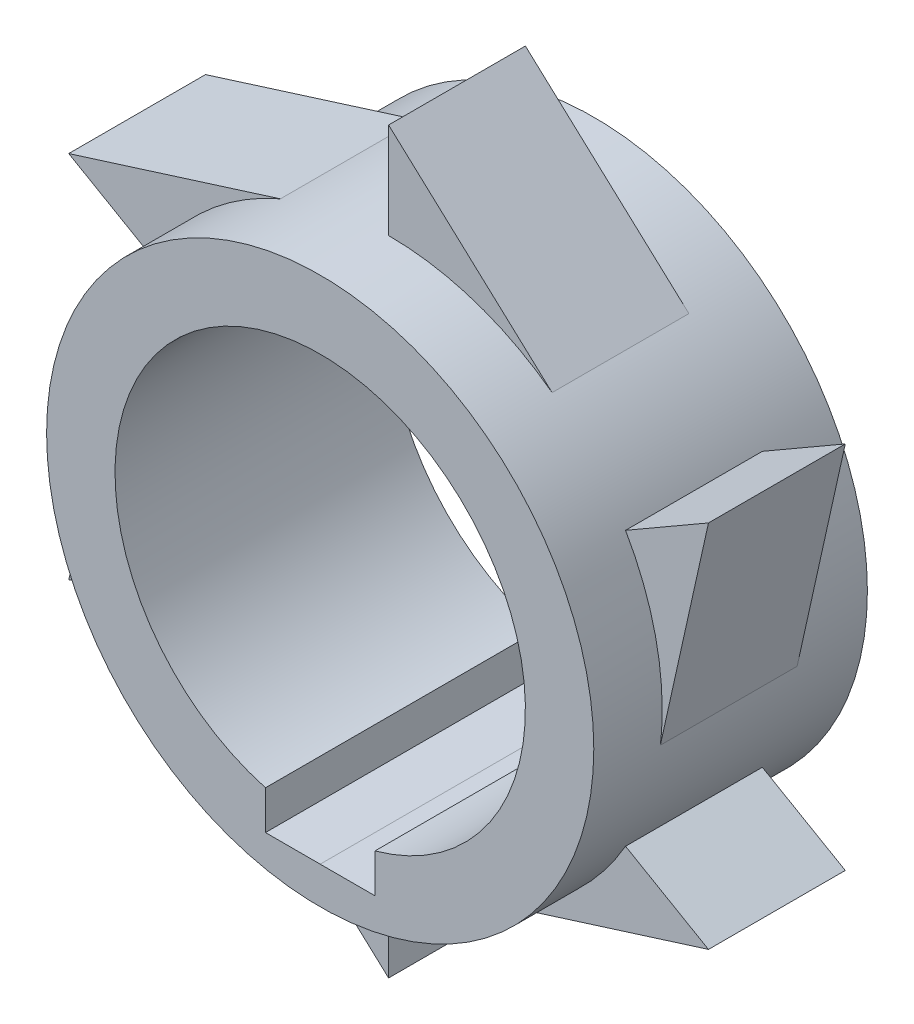
ISO-10303-21;
HEADER;
FILE_DESCRIPTION(('STEP AP214'),'2;1');
FILE_NAME('part.step','',(''),(''),'','','');
FILE_SCHEMA(('AUTOMOTIVE_DESIGN { 1 0 10303 214 1 1 1 1 }'));
ENDSEC;
DATA;
#1=APPLICATION_CONTEXT('core data for automotive mechanical design processes');
#2=APPLICATION_PROTOCOL_DEFINITION('international standard','automotive_design',2000,#1);
#3=PRODUCT_CONTEXT('',#1,'mechanical');
#4=PRODUCT('Part','Part','',(#3));
#5=PRODUCT_RELATED_PRODUCT_CATEGORY('part','',(#4));
#6=PRODUCT_DEFINITION_FORMATION('','',#4);
#7=PRODUCT_DEFINITION_CONTEXT('part definition',#1,'design');
#8=PRODUCT_DEFINITION('design','',#6,#7);
#9=PRODUCT_DEFINITION_SHAPE('','',#8);
#10=(LENGTH_UNIT() NAMED_UNIT(*) SI_UNIT(.MILLI.,.METRE.));
#11=(NAMED_UNIT(*) PLANE_ANGLE_UNIT() SI_UNIT($,.RADIAN.));
#12=(NAMED_UNIT(*) SI_UNIT($,.STERADIAN.) SOLID_ANGLE_UNIT());
#13=UNCERTAINTY_MEASURE_WITH_UNIT(LENGTH_MEASURE(1.E-05),#10,'distance_accuracy_value','');
#14=(GEOMETRIC_REPRESENTATION_CONTEXT(3) GLOBAL_UNCERTAINTY_ASSIGNED_CONTEXT((#13)) GLOBAL_UNIT_ASSIGNED_CONTEXT((#10,
#11,#12)) REPRESENTATION_CONTEXT('',''));
#15=CARTESIAN_POINT('',(0.,0.,0.));
#16=DIRECTION('',(0.,0.,1.));
#17=DIRECTION('',(1.,0.,0.));
#18=AXIS2_PLACEMENT_3D('',#15,#16,#17);
#19=CARTESIAN_POINT('',(0.,0.,20.));
#20=DIRECTION('',(0.,0.,1.));
#21=DIRECTION('',(1.,0.,0.));
#22=AXIS2_PLACEMENT_3D('',#19,#20,#21);
#23=PLANE('',#22);
#24=CARTESIAN_POINT('',(0.,0.,20.));
#25=DIRECTION('',(0.,0.,1.));
#26=DIRECTION('',(1.,0.,0.));
#27=AXIS2_PLACEMENT_3D('',#24,#25,#26);
#28=CIRCLE('',#27,20.);
#29=CARTESIAN_POINT('',(20.,0.,20.));
#30=VERTEX_POINT('',#29);
#31=EDGE_CURVE('E368',#30,#30,#28,.T.);
#32=ORIENTED_EDGE('',*,*,#31,.T.);
#33=EDGE_LOOP('',(#32));
#34=FACE_BOUND('',#33,.T.);
#35=DIRECTION('',(-1.,0.,0.));
#36=VECTOR('',#35,1.);
#37=CARTESIAN_POINT('',(0.,-17.2932558970192,20.));
#38=LINE('',#37,#36);
#39=CARTESIAN_POINT('',(0.,-17.2932558970192,20.));
#40=VERTEX_POINT('',#39);
#41=CARTESIAN_POINT('',(-4.,-17.2932558970192,20.));
#42=VERTEX_POINT('',#41);
#43=EDGE_CURVE('E358',#40,#42,#38,.T.);
#44=ORIENTED_EDGE('',*,*,#43,.T.);
#45=DIRECTION('',(0.,1.,0.));
#46=VECTOR('',#45,1.);
#47=CARTESIAN_POINT('',(-4.,0.,20.));
#48=LINE('',#47,#46);
#49=CARTESIAN_POINT('',(-4.,-14.456832294801,20.));
#50=VERTEX_POINT('',#49);
#51=EDGE_CURVE('E352',#42,#50,#48,.T.);
#52=ORIENTED_EDGE('',*,*,#51,.T.);
#53=CARTESIAN_POINT('',(0.,0.,20.));
#54=DIRECTION('',(0.,0.,1.));
#55=DIRECTION('',(1.,0.,0.));
#56=AXIS2_PLACEMENT_3D('',#53,#54,#55);
#57=CIRCLE('',#56,15.);
#58=CARTESIAN_POINT('',(4.,-14.456832294801,20.));
#59=VERTEX_POINT('',#58);
#60=EDGE_CURVE('E362',#59,#50,#57,.T.);
#61=ORIENTED_EDGE('',*,*,#60,.F.);
#62=DIRECTION('',(0.,-1.,0.));
#63=VECTOR('',#62,1.);
#64=CARTESIAN_POINT('',(4.,0.,20.));
#65=LINE('',#64,#63);
#66=CARTESIAN_POINT('',(4.,-17.2932558970192,20.));
#67=VERTEX_POINT('',#66);
#68=EDGE_CURVE('E347',#59,#67,#65,.T.);
#69=ORIENTED_EDGE('',*,*,#68,.T.);
#70=DIRECTION('',(-1.,0.,0.));
#71=VECTOR('',#70,1.);
#72=CARTESIAN_POINT('',(0.,-17.2932558970192,20.));
#73=LINE('',#72,#71);
#74=EDGE_CURVE('E355',#67,#40,#73,.T.);
#75=ORIENTED_EDGE('',*,*,#74,.T.);
#76=EDGE_LOOP('',(#44,#52,#61,#69,#75));
#77=FACE_BOUND('',#76,.T.);
#78=ADVANCED_FACE('F41',(#34,#77),#23,.T.);
#79=CARTESIAN_POINT('',(0.,0.,0.));
#80=DIRECTION('',(0.,0.,1.));
#81=DIRECTION('',(1.,0.,0.));
#82=AXIS2_PLACEMENT_3D('',#79,#80,#81);
#83=PLANE('',#82);
#84=CARTESIAN_POINT('',(0.,0.,0.));
#85=DIRECTION('',(0.,0.,1.));
#86=DIRECTION('',(1.,0.,0.));
#87=AXIS2_PLACEMENT_3D('',#84,#85,#86);
#88=CIRCLE('',#87,20.);
#89=CARTESIAN_POINT('',(20.,0.,0.));
#90=VERTEX_POINT('',#89);
#91=EDGE_CURVE('E365',#90,#90,#88,.T.);
#92=ORIENTED_EDGE('',*,*,#91,.F.);
#93=EDGE_LOOP('',(#92));
#94=FACE_BOUND('',#93,.T.);
#95=DIRECTION('',(0.,1.,0.));
#96=VECTOR('',#95,1.);
#97=CARTESIAN_POINT('',(-4.,0.,0.));
#98=LINE('',#97,#96);
#99=CARTESIAN_POINT('',(-4.,-17.2932558970192,0.));
#100=VERTEX_POINT('',#99);
#101=CARTESIAN_POINT('',(-4.,-14.456832294801,0.));
#102=VERTEX_POINT('',#101);
#103=EDGE_CURVE('E350',#100,#102,#98,.T.);
#104=ORIENTED_EDGE('',*,*,#103,.F.);
#105=DIRECTION('',(-1.,0.,0.));
#106=VECTOR('',#105,1.);
#107=CARTESIAN_POINT('',(0.,-17.2932558970192,0.));
#108=LINE('',#107,#106);
#109=CARTESIAN_POINT('',(0.,-17.2932558970192,0.));
#110=VERTEX_POINT('',#109);
#111=EDGE_CURVE('E12',#110,#100,#108,.T.);
#112=ORIENTED_EDGE('',*,*,#111,.F.);
#113=DIRECTION('',(-1.,0.,0.));
#114=VECTOR('',#113,1.);
#115=CARTESIAN_POINT('',(0.,-17.2932558970192,0.));
#116=LINE('',#115,#114);
#117=CARTESIAN_POINT('',(4.,-17.2932558970192,0.));
#118=VERTEX_POINT('',#117);
#119=EDGE_CURVE('E49',#118,#110,#116,.T.);
#120=ORIENTED_EDGE('',*,*,#119,.F.);
#121=DIRECTION('',(0.,-1.,0.));
#122=VECTOR('',#121,1.);
#123=CARTESIAN_POINT('',(4.,0.,0.));
#124=LINE('',#123,#122);
#125=CARTESIAN_POINT('',(4.,-14.456832294801,0.));
#126=VERTEX_POINT('',#125);
#127=EDGE_CURVE('E345',#126,#118,#124,.T.);
#128=ORIENTED_EDGE('',*,*,#127,.F.);
#129=CARTESIAN_POINT('',(0.,0.,0.));
#130=DIRECTION('',(0.,0.,1.));
#131=DIRECTION('',(1.,0.,0.));
#132=AXIS2_PLACEMENT_3D('',#129,#130,#131);
#133=CIRCLE('',#132,15.);
#134=EDGE_CURVE('E361',#126,#102,#133,.T.);
#135=ORIENTED_EDGE('',*,*,#134,.T.);
#136=EDGE_LOOP('',(#104,#112,#120,#128,#135));
#137=FACE_BOUND('',#136,.T.);
#138=ADVANCED_FACE('F390',(#94,#137),#83,.F.);
#139=CARTESIAN_POINT('',(0.,0.,20.));
#140=DIRECTION('',(0.,0.,-1.));
#141=DIRECTION('',(-1.,0.,0.));
#142=AXIS2_PLACEMENT_3D('',#139,#140,#141);
#143=CYLINDRICAL_SURFACE('',#142,15.);
#144=ORIENTED_EDGE('',*,*,#60,.T.);
#145=DIRECTION('',(0.,0.,-1.));
#146=VECTOR('',#145,1.);
#147=CARTESIAN_POINT('',(-4.,-14.456832294801,20.));
#148=LINE('',#147,#146);
#149=EDGE_CURVE('E376',#50,#102,#148,.T.);
#150=ORIENTED_EDGE('',*,*,#149,.T.);
#151=ORIENTED_EDGE('',*,*,#134,.F.);
#152=DIRECTION('',(0.,0.,-1.));
#153=VECTOR('',#152,1.);
#154=CARTESIAN_POINT('',(4.,-14.456832294801,20.));
#155=LINE('',#154,#153);
#156=EDGE_CURVE('E371',#126,#59,#155,.F.);
#157=ORIENTED_EDGE('',*,*,#156,.T.);
#158=EDGE_LOOP('',(#144,#150,#151,#157));
#159=FACE_BOUND('',#158,.T.);
#160=ADVANCED_FACE('F395',(#159),#143,.F.);
#161=CARTESIAN_POINT('',(0.,0.,20.));
#162=DIRECTION('',(0.,0.,-1.));
#163=DIRECTION('',(-1.,0.,0.));
#164=AXIS2_PLACEMENT_3D('',#161,#162,#163);
#165=CYLINDRICAL_SURFACE('',#164,20.);
#166=CARTESIAN_POINT('',(0.,0.,5.));
#167=DIRECTION('',(0.,0.,1.));
#168=DIRECTION('',(0.50000000000001,0.866025403784433,0.));
#169=AXIS2_PLACEMENT_3D('',#166,#167,#168);
#170=CIRCLE('',#169,20.);
#171=CARTESIAN_POINT('',(-7.9107393766514,18.3690011300206,5.));
#172=VERTEX_POINT('',#171);
#173=CARTESIAN_POINT('',(-17.3205080756887,10.0000000000002,5.));
#174=VERTEX_POINT('',#173);
#175=EDGE_CURVE('E193',#172,#174,#170,.T.);
#176=ORIENTED_EDGE('',*,*,#175,.F.);
#177=DIRECTION('',(0.,0.,-1.));
#178=VECTOR('',#177,1.);
#179=CARTESIAN_POINT('',(-7.9107393766514,18.3690011300206,15.));
#180=LINE('',#179,#178);
#181=CARTESIAN_POINT('',(-7.91073937665136,18.3690011300206,15.));
#182=VERTEX_POINT('',#181);
#183=EDGE_CURVE('E56',#182,#172,#180,.T.);
#184=ORIENTED_EDGE('',*,*,#183,.F.);
#185=CARTESIAN_POINT('',(0.,0.,15.));
#186=DIRECTION('',(0.,0.,1.));
#187=DIRECTION('',(0.50000000000001,0.866025403784433,0.));
#188=AXIS2_PLACEMENT_3D('',#185,#186,#187);
#189=CIRCLE('',#188,20.);
#190=CARTESIAN_POINT('',(-17.3205080756887,10.0000000000002,15.));
#191=VERTEX_POINT('',#190);
#192=EDGE_CURVE('E60',#182,#191,#189,.T.);
#193=ORIENTED_EDGE('',*,*,#192,.T.);
#194=DIRECTION('',(0.,0.,-1.));
#195=VECTOR('',#194,1.);
#196=CARTESIAN_POINT('',(-17.3205080756887,10.0000000000002,15.));
#197=LINE('',#196,#195);
#198=EDGE_CURVE('E190',#191,#174,#197,.T.);
#199=ORIENTED_EDGE('',*,*,#198,.T.);
#200=EDGE_LOOP('',(#176,#184,#193,#199));
#201=FACE_BOUND('',#200,.T.);
#202=CARTESIAN_POINT('',(0.,0.,5.));
#203=DIRECTION('',(0.,0.,1.));
#204=DIRECTION('',(-0.499999999999992,0.866025403784443,0.));
#205=AXIS2_PLACEMENT_3D('',#202,#203,#204);
#206=CIRCLE('',#205,20.);
#207=CARTESIAN_POINT('',(-19.8633913090686,2.33359930211225,5.));
#208=VERTEX_POINT('',#207);
#209=CARTESIAN_POINT('',(-17.3205080756889,-9.99999999999984,5.));
#210=VERTEX_POINT('',#209);
#211=EDGE_CURVE('E220',#208,#210,#206,.T.);
#212=ORIENTED_EDGE('',*,*,#211,.F.);
#213=DIRECTION('',(0.,0.,-1.));
#214=VECTOR('',#213,1.);
#215=CARTESIAN_POINT('',(-19.8633913090686,2.33359930211225,15.));
#216=LINE('',#215,#214);
#217=CARTESIAN_POINT('',(-19.8633913090686,2.33359930211229,15.));
#218=VERTEX_POINT('',#217);
#219=EDGE_CURVE('E240',#218,#208,#216,.T.);
#220=ORIENTED_EDGE('',*,*,#219,.F.);
#221=CARTESIAN_POINT('',(0.,0.,15.));
#222=DIRECTION('',(0.,0.,1.));
#223=DIRECTION('',(-0.499999999999992,0.866025403784443,0.));
#224=AXIS2_PLACEMENT_3D('',#221,#222,#223);
#225=CIRCLE('',#224,20.);
#226=CARTESIAN_POINT('',(-17.3205080756889,-9.99999999999984,15.));
#227=VERTEX_POINT('',#226);
#228=EDGE_CURVE('E235',#218,#227,#225,.T.);
#229=ORIENTED_EDGE('',*,*,#228,.T.);
#230=DIRECTION('',(0.,0.,-1.));
#231=VECTOR('',#230,1.);
#232=CARTESIAN_POINT('',(-17.3205080756889,-9.99999999999984,15.));
#233=LINE('',#232,#231);
#234=EDGE_CURVE('E228',#227,#210,#233,.T.);
#235=ORIENTED_EDGE('',*,*,#234,.T.);
#236=EDGE_LOOP('',(#212,#220,#229,#235));
#237=FACE_BOUND('',#236,.T.);
#238=CARTESIAN_POINT('',(0.,0.,5.));
#239=DIRECTION('',(0.,0.,1.));
#240=DIRECTION('',(-1.,0.,0.));
#241=AXIS2_PLACEMENT_3D('',#238,#239,#240);
#242=CIRCLE('',#241,20.);
#243=CARTESIAN_POINT('',(-11.952651932417,-16.0354018279084,5.));
#244=VERTEX_POINT('',#243);
#245=CARTESIAN_POINT('',(0.,-20.,5.));
#246=VERTEX_POINT('',#245);
#247=EDGE_CURVE('E243',#244,#246,#242,.T.);
#248=ORIENTED_EDGE('',*,*,#247,.F.);
#249=DIRECTION('',(0.,0.,-1.));
#250=VECTOR('',#249,1.);
#251=CARTESIAN_POINT('',(-11.952651932417,-16.0354018279084,15.));
#252=LINE('',#251,#250);
#253=CARTESIAN_POINT('',(-11.952651932417,-16.0354018279084,15.));
#254=VERTEX_POINT('',#253);
#255=EDGE_CURVE('E263',#254,#244,#252,.T.);
#256=ORIENTED_EDGE('',*,*,#255,.F.);
#257=CARTESIAN_POINT('',(0.,0.,15.));
#258=DIRECTION('',(0.,0.,1.));
#259=DIRECTION('',(-1.,0.,0.));
#260=AXIS2_PLACEMENT_3D('',#257,#258,#259);
#261=CIRCLE('',#260,20.);
#262=CARTESIAN_POINT('',(0.,-20.,15.));
#263=VERTEX_POINT('',#262);
#264=EDGE_CURVE('E258',#254,#263,#261,.T.);
#265=ORIENTED_EDGE('',*,*,#264,.T.);
#266=DIRECTION('',(0.,0.,-1.));
#267=VECTOR('',#266,1.);
#268=CARTESIAN_POINT('',(0.,-20.,15.));
#269=LINE('',#268,#267);
#270=EDGE_CURVE('E251',#263,#246,#269,.T.);
#271=ORIENTED_EDGE('',*,*,#270,.T.);
#272=EDGE_LOOP('',(#248,#256,#265,#271));
#273=FACE_BOUND('',#272,.T.);
#274=CARTESIAN_POINT('',(0.,0.,5.));
#275=DIRECTION('',(0.,0.,1.));
#276=DIRECTION('',(-0.500000000000004,-0.866025403784436,0.));
#277=AXIS2_PLACEMENT_3D('',#274,#275,#276);
#278=CIRCLE('',#277,20.);
#279=CARTESIAN_POINT('',(7.91073937665153,-18.3690011300205,5.));
#280=VERTEX_POINT('',#279);
#281=CARTESIAN_POINT('',(17.3205080756887,-10.0000000000001,5.));
#282=VERTEX_POINT('',#281);
#283=EDGE_CURVE('E266',#280,#282,#278,.T.);
#284=ORIENTED_EDGE('',*,*,#283,.F.);
#285=DIRECTION('',(0.,0.,-1.));
#286=VECTOR('',#285,1.);
#287=CARTESIAN_POINT('',(7.91073937665153,-18.3690011300205,15.));
#288=LINE('',#287,#286);
#289=CARTESIAN_POINT('',(7.91073937665149,-18.3690011300205,15.));
#290=VERTEX_POINT('',#289);
#291=EDGE_CURVE('E286',#290,#280,#288,.T.);
#292=ORIENTED_EDGE('',*,*,#291,.F.);
#293=CARTESIAN_POINT('',(0.,0.,15.));
#294=DIRECTION('',(0.,0.,1.));
#295=DIRECTION('',(-0.500000000000004,-0.866025403784436,0.));
#296=AXIS2_PLACEMENT_3D('',#293,#294,#295);
#297=CIRCLE('',#296,20.);
#298=CARTESIAN_POINT('',(17.3205080756887,-10.0000000000001,15.));
#299=VERTEX_POINT('',#298);
#300=EDGE_CURVE('E281',#290,#299,#297,.T.);
#301=ORIENTED_EDGE('',*,*,#300,.T.);
#302=DIRECTION('',(0.,0.,-1.));
#303=VECTOR('',#302,1.);
#304=CARTESIAN_POINT('',(17.3205080756887,-10.0000000000001,15.));
#305=LINE('',#304,#303);
#306=EDGE_CURVE('E274',#299,#282,#305,.T.);
#307=ORIENTED_EDGE('',*,*,#306,.T.);
#308=EDGE_LOOP('',(#284,#292,#301,#307));
#309=FACE_BOUND('',#308,.T.);
#310=CARTESIAN_POINT('',(0.,0.,5.));
#311=DIRECTION('',(0.,0.,1.));
#312=DIRECTION('',(0.499999999999998,-0.86602540378444,0.));
#313=AXIS2_PLACEMENT_3D('',#310,#311,#312);
#314=CIRCLE('',#313,20.);
#315=CARTESIAN_POINT('',(19.8633913090686,-2.33359930211211,5.));
#316=VERTEX_POINT('',#315);
#317=CARTESIAN_POINT('',(17.3205080756888,9.99999999999996,5.));
#318=VERTEX_POINT('',#317);
#319=EDGE_CURVE('E289',#316,#318,#314,.T.);
#320=ORIENTED_EDGE('',*,*,#319,.F.);
#321=DIRECTION('',(0.,0.,-1.));
#322=VECTOR('',#321,1.);
#323=CARTESIAN_POINT('',(19.8633913090686,-2.33359930211211,15.));
#324=LINE('',#323,#322);
#325=CARTESIAN_POINT('',(19.8633913090686,-2.33359930211215,15.));
#326=VERTEX_POINT('',#325);
#327=EDGE_CURVE('E309',#326,#316,#324,.T.);
#328=ORIENTED_EDGE('',*,*,#327,.F.);
#329=CARTESIAN_POINT('',(0.,0.,15.));
#330=DIRECTION('',(0.,0.,1.));
#331=DIRECTION('',(0.499999999999998,-0.86602540378444,0.));
#332=AXIS2_PLACEMENT_3D('',#329,#330,#331);
#333=CIRCLE('',#332,20.);
#334=CARTESIAN_POINT('',(17.3205080756888,9.99999999999996,15.));
#335=VERTEX_POINT('',#334);
#336=EDGE_CURVE('E304',#326,#335,#333,.T.);
#337=ORIENTED_EDGE('',*,*,#336,.T.);
#338=DIRECTION('',(0.,0.,-1.));
#339=VECTOR('',#338,1.);
#340=CARTESIAN_POINT('',(17.3205080756888,9.99999999999996,15.));
#341=LINE('',#340,#339);
#342=EDGE_CURVE('E297',#335,#318,#341,.T.);
#343=ORIENTED_EDGE('',*,*,#342,.T.);
#344=EDGE_LOOP('',(#320,#328,#337,#343));
#345=FACE_BOUND('',#344,.T.);
#346=DIRECTION('',(0.,0.,-1.));
#347=VECTOR('',#346,1.);
#348=CARTESIAN_POINT('',(11.952651932417,16.0354018279084,15.));
#349=LINE('',#348,#347);
#350=CARTESIAN_POINT('',(11.952651932417,16.0354018279084,15.));
#351=VERTEX_POINT('',#350);
#352=CARTESIAN_POINT('',(11.952651932417,16.0354018279084,5.));
#353=VERTEX_POINT('',#352);
#354=EDGE_CURVE('E333',#351,#353,#349,.T.);
#355=ORIENTED_EDGE('',*,*,#354,.F.);
#356=CARTESIAN_POINT('',(0.,0.,15.));
#357=DIRECTION('',(0.,0.,1.));
#358=DIRECTION('',(1.,0.,0.));
#359=AXIS2_PLACEMENT_3D('',#356,#357,#358);
#360=CIRCLE('',#359,20.);
#361=CARTESIAN_POINT('',(0.,20.,15.));
#362=VERTEX_POINT('',#361);
#363=EDGE_CURVE('E313',#351,#362,#360,.T.);
#364=ORIENTED_EDGE('',*,*,#363,.T.);
#365=DIRECTION('',(0.,0.,-1.));
#366=VECTOR('',#365,1.);
#367=CARTESIAN_POINT('',(0.,20.,15.));
#368=LINE('',#367,#366);
#369=CARTESIAN_POINT('',(0.,20.,5.));
#370=VERTEX_POINT('',#369);
#371=EDGE_CURVE('E322',#362,#370,#368,.T.);
#372=ORIENTED_EDGE('',*,*,#371,.T.);
#373=CARTESIAN_POINT('',(0.,0.,5.));
#374=DIRECTION('',(0.,0.,1.));
#375=DIRECTION('',(1.,0.,0.));
#376=AXIS2_PLACEMENT_3D('',#373,#374,#375);
#377=CIRCLE('',#376,20.);
#378=EDGE_CURVE('E312',#353,#370,#377,.T.);
#379=ORIENTED_EDGE('',*,*,#378,.F.);
#380=EDGE_LOOP('',(#355,#364,#372,#379));
#381=FACE_BOUND('',#380,.T.);
#382=ORIENTED_EDGE('',*,*,#31,.F.);
#383=EDGE_LOOP('',(#382));
#384=FACE_BOUND('',#383,.T.);
#385=ORIENTED_EDGE('',*,*,#91,.T.);
#386=EDGE_LOOP('',(#385));
#387=FACE_BOUND('',#386,.T.);
#388=ADVANCED_FACE('F43',(#201,#237,#273,#309,#345,#381,#384,#387),#165,.T.);
#389=CARTESIAN_POINT('',(0.,-17.2932558970192,100.));
#390=DIRECTION('',(0.,1.,0.));
#391=DIRECTION('',(0.,0.,1.));
#392=AXIS2_PLACEMENT_3D('',#389,#390,#391);
#393=PLANE('',#392);
#394=ORIENTED_EDGE('',*,*,#43,.F.);
#395=DIRECTION('',(0.,0.,-1.));
#396=VECTOR('',#395,1.);
#397=CARTESIAN_POINT('',(0.,-17.2932558970192,100.));
#398=LINE('',#397,#396);
#399=EDGE_CURVE('E339',#40,#110,#398,.T.);
#400=ORIENTED_EDGE('',*,*,#399,.T.);
#401=ORIENTED_EDGE('',*,*,#111,.T.);
#402=DIRECTION('',(0.,0.,-1.));
#403=VECTOR('',#402,1.);
#404=CARTESIAN_POINT('',(-4.,-17.2932558970192,100.));
#405=LINE('',#404,#403);
#406=EDGE_CURVE('E342',#42,#100,#405,.T.);
#407=ORIENTED_EDGE('',*,*,#406,.F.);
#408=EDGE_LOOP('',(#394,#400,#401,#407));
#409=FACE_BOUND('',#408,.T.);
#410=ADVANCED_FACE('F387',(#409),#393,.T.);
#411=CARTESIAN_POINT('',(0.,-17.2932558970192,100.));
#412=DIRECTION('',(0.,1.,0.));
#413=DIRECTION('',(0.,0.,1.));
#414=AXIS2_PLACEMENT_3D('',#411,#412,#413);
#415=PLANE('',#414);
#416=ORIENTED_EDGE('',*,*,#74,.F.);
#417=DIRECTION('',(0.,0.,-1.));
#418=VECTOR('',#417,1.);
#419=CARTESIAN_POINT('',(4.,-17.2932558970192,100.));
#420=LINE('',#419,#418);
#421=EDGE_CURVE('E336',#67,#118,#420,.T.);
#422=ORIENTED_EDGE('',*,*,#421,.T.);
#423=ORIENTED_EDGE('',*,*,#119,.T.);
#424=ORIENTED_EDGE('',*,*,#399,.F.);
#425=EDGE_LOOP('',(#416,#422,#423,#424));
#426=FACE_BOUND('',#425,.T.);
#427=ADVANCED_FACE('F381',(#426),#415,.T.);
#428=CARTESIAN_POINT('',(-4.,-17.2932558970192,100.));
#429=DIRECTION('',(1.,0.,0.));
#430=DIRECTION('',(0.,0.,-1.));
#431=AXIS2_PLACEMENT_3D('',#428,#429,#430);
#432=PLANE('',#431);
#433=ORIENTED_EDGE('',*,*,#51,.F.);
#434=ORIENTED_EDGE('',*,*,#406,.T.);
#435=ORIENTED_EDGE('',*,*,#103,.T.);
#436=ORIENTED_EDGE('',*,*,#149,.F.);
#437=EDGE_LOOP('',(#433,#434,#435,#436));
#438=FACE_BOUND('',#437,.T.);
#439=ADVANCED_FACE('F393',(#438),#432,.T.);
#440=CARTESIAN_POINT('',(4.,-17.2932558970192,100.));
#441=DIRECTION('',(-1.,0.,0.));
#442=DIRECTION('',(0.,0.,1.));
#443=AXIS2_PLACEMENT_3D('',#440,#441,#442);
#444=PLANE('',#443);
#445=ORIENTED_EDGE('',*,*,#68,.F.);
#446=ORIENTED_EDGE('',*,*,#156,.F.);
#447=ORIENTED_EDGE('',*,*,#127,.T.);
#448=ORIENTED_EDGE('',*,*,#421,.F.);
#449=EDGE_LOOP('',(#445,#446,#447,#448));
#450=FACE_BOUND('',#449,.T.);
#451=ADVANCED_FACE('F399',(#450),#444,.T.);
#452=CARTESIAN_POINT('',(13.449905115185,14.6619175497951,15.));
#453=DIRECTION('',(0.675992615842997,0.736908395477852,0.));
#454=DIRECTION('',(-0.736908395477852,0.675992615842997,0.));
#455=AXIS2_PLACEMENT_3D('',#452,#453,#454);
#456=PLANE('',#455);
#457=DIRECTION('',(0.736908395477852,-0.675992615842997,0.));
#458=VECTOR('',#457,1.);
#459=CARTESIAN_POINT('',(13.449905115185,14.6619175497951,5.));
#460=LINE('',#459,#458);
#461=CARTESIAN_POINT('',(0.,27.,5.));
#462=VERTEX_POINT('',#461);
#463=EDGE_CURVE('E325',#462,#353,#460,.T.);
#464=ORIENTED_EDGE('',*,*,#463,.F.);
#465=DIRECTION('',(0.,0.,-1.));
#466=VECTOR('',#465,1.);
#467=CARTESIAN_POINT('',(0.,27.,15.));
#468=LINE('',#467,#466);
#469=CARTESIAN_POINT('',(0.,27.,15.));
#470=VERTEX_POINT('',#469);
#471=EDGE_CURVE('E331',#470,#462,#468,.T.);
#472=ORIENTED_EDGE('',*,*,#471,.F.);
#473=DIRECTION('',(0.736908395477852,-0.675992615842997,0.));
#474=VECTOR('',#473,1.);
#475=CARTESIAN_POINT('',(13.449905115185,14.6619175497951,15.));
#476=LINE('',#475,#474);
#477=EDGE_CURVE('E315',#470,#351,#476,.T.);
#478=ORIENTED_EDGE('',*,*,#477,.T.);
#479=ORIENTED_EDGE('',*,*,#354,.T.);
#480=EDGE_LOOP('',(#464,#472,#478,#479));
#481=FACE_BOUND('',#480,.T.);
#482=ADVANCED_FACE('F401',(#481),#456,.T.);
#483=CARTESIAN_POINT('',(0.,0.,15.));
#484=DIRECTION('',(-1.,0.,0.));
#485=DIRECTION('',(0.,0.,1.));
#486=AXIS2_PLACEMENT_3D('',#483,#484,#485);
#487=PLANE('',#486);
#488=DIRECTION('',(0.,1.,0.));
#489=VECTOR('',#488,1.);
#490=CARTESIAN_POINT('',(0.,0.,5.));
#491=LINE('',#490,#489);
#492=EDGE_CURVE('E316',#370,#462,#491,.T.);
#493=ORIENTED_EDGE('',*,*,#492,.F.);
#494=ORIENTED_EDGE('',*,*,#371,.F.);
#495=DIRECTION('',(0.,1.,0.));
#496=VECTOR('',#495,1.);
#497=CARTESIAN_POINT('',(0.,0.,15.));
#498=LINE('',#497,#496);
#499=EDGE_CURVE('E319',#362,#470,#498,.T.);
#500=ORIENTED_EDGE('',*,*,#499,.T.);
#501=ORIENTED_EDGE('',*,*,#471,.T.);
#502=EDGE_LOOP('',(#493,#494,#500,#501));
#503=FACE_BOUND('',#502,.T.);
#504=ADVANCED_FACE('F407',(#503),#487,.T.);
#505=CARTESIAN_POINT('',(0.,0.,15.));
#506=DIRECTION('',(0.,0.,1.));
#507=DIRECTION('',(1.,0.,0.));
#508=AXIS2_PLACEMENT_3D('',#505,#506,#507);
#509=PLANE('',#508);
#510=ORIENTED_EDGE('',*,*,#363,.F.);
#511=ORIENTED_EDGE('',*,*,#477,.F.);
#512=ORIENTED_EDGE('',*,*,#499,.F.);
#513=EDGE_LOOP('',(#510,#511,#512));
#514=FACE_BOUND('',#513,.T.);
#515=ADVANCED_FACE('F452',(#514),#509,.T.);
#516=CARTESIAN_POINT('',(0.,0.,5.));
#517=DIRECTION('',(0.,0.,1.));
#518=DIRECTION('',(1.,0.,0.));
#519=AXIS2_PLACEMENT_3D('',#516,#517,#518);
#520=PLANE('',#519);
#521=ORIENTED_EDGE('',*,*,#378,.T.);
#522=ORIENTED_EDGE('',*,*,#492,.T.);
#523=ORIENTED_EDGE('',*,*,#463,.T.);
#524=EDGE_LOOP('',(#521,#522,#523));
#525=FACE_BOUND('',#524,.T.);
#526=ADVANCED_FACE('F462',(#525),#520,.F.);
#527=CARTESIAN_POINT('',(19.4225456239079,-4.31700073334295,15.));
#528=DIRECTION('',(0.976177698667348,-0.216972580351806,0.));
#529=DIRECTION('',(0.216972580351806,0.976177698667348,0.));
#530=AXIS2_PLACEMENT_3D('',#527,#528,#529);
#531=PLANE('',#530);
#532=DIRECTION('',(-0.216972580351806,-0.976177698667348,0.));
#533=VECTOR('',#532,1.);
#534=CARTESIAN_POINT('',(19.4225456239079,-4.31700073334295,5.));
#535=LINE('',#534,#533);
#536=CARTESIAN_POINT('',(23.3826859021799,13.4999999999999,5.));
#537=VERTEX_POINT('',#536);
#538=EDGE_CURVE('E294',#537,#316,#535,.T.);
#539=ORIENTED_EDGE('',*,*,#538,.F.);
#540=DIRECTION('',(0.,0.,-1.));
#541=VECTOR('',#540,1.);
#542=CARTESIAN_POINT('',(23.3826859021799,13.4999999999999,15.));
#543=LINE('',#542,#541);
#544=CARTESIAN_POINT('',(23.3826859021799,13.4999999999999,15.));
#545=VERTEX_POINT('',#544);
#546=EDGE_CURVE('E301',#545,#537,#543,.T.);
#547=ORIENTED_EDGE('',*,*,#546,.F.);
#548=DIRECTION('',(-0.216972580351806,-0.976177698667348,0.));
#549=VECTOR('',#548,1.);
#550=CARTESIAN_POINT('',(19.4225456239079,-4.31700073334295,15.));
#551=LINE('',#550,#549);
#552=EDGE_CURVE('E306',#545,#326,#551,.T.);
#553=ORIENTED_EDGE('',*,*,#552,.T.);
#554=ORIENTED_EDGE('',*,*,#327,.T.);
#555=EDGE_LOOP('',(#539,#547,#553,#554));
#556=FACE_BOUND('',#555,.T.);
#557=ADVANCED_FACE('F472',(#556),#531,.T.);
#558=CARTESIAN_POINT('',(0.,0.,15.));
#559=DIRECTION('',(0.,0.,1.));
#560=DIRECTION('',(0.499999999999998,-0.86602540378444,0.));
#561=AXIS2_PLACEMENT_3D('',#558,#559,#560);
#562=PLANE('',#561);
#563=ORIENTED_EDGE('',*,*,#336,.F.);
#564=ORIENTED_EDGE('',*,*,#552,.F.);
#565=DIRECTION('',(0.86602540378444,0.499999999999998,0.));
#566=VECTOR('',#565,1.);
#567=CARTESIAN_POINT('',(0.,0.,15.));
#568=LINE('',#567,#566);
#569=EDGE_CURVE('E299',#335,#545,#568,.T.);
#570=ORIENTED_EDGE('',*,*,#569,.F.);
#571=EDGE_LOOP('',(#563,#564,#570));
#572=FACE_BOUND('',#571,.T.);
#573=ADVANCED_FACE('F489',(#572),#562,.T.);
#574=CARTESIAN_POINT('',(0.,0.,15.));
#575=DIRECTION('',(-0.499999999999998,0.86602540378444,0.));
#576=DIRECTION('',(0.,0.,1.));
#577=AXIS2_PLACEMENT_3D('',#574,#575,#576);
#578=PLANE('',#577);
#579=DIRECTION('',(0.86602540378444,0.499999999999998,0.));
#580=VECTOR('',#579,1.);
#581=CARTESIAN_POINT('',(0.,0.,5.));
#582=LINE('',#581,#580);
#583=EDGE_CURVE('E292',#318,#537,#582,.T.);
#584=ORIENTED_EDGE('',*,*,#583,.F.);
#585=ORIENTED_EDGE('',*,*,#342,.F.);
#586=ORIENTED_EDGE('',*,*,#569,.T.);
#587=ORIENTED_EDGE('',*,*,#546,.T.);
#588=EDGE_LOOP('',(#584,#585,#586,#587));
#589=FACE_BOUND('',#588,.T.);
#590=ADVANCED_FACE('F499',(#589),#578,.T.);
#591=CARTESIAN_POINT('',(0.,0.,5.));
#592=DIRECTION('',(0.,0.,1.));
#593=DIRECTION('',(0.499999999999998,-0.86602540378444,0.));
#594=AXIS2_PLACEMENT_3D('',#591,#592,#593);
#595=PLANE('',#594);
#596=ORIENTED_EDGE('',*,*,#319,.T.);
#597=ORIENTED_EDGE('',*,*,#583,.T.);
#598=ORIENTED_EDGE('',*,*,#538,.T.);
#599=EDGE_LOOP('',(#596,#597,#598));
#600=FACE_BOUND('',#599,.T.);
#601=ADVANCED_FACE('F509',(#600),#595,.F.);
#602=CARTESIAN_POINT('',(5.97264050872285,-18.978918283138,15.));
#603=DIRECTION('',(0.300185082824347,-0.953880975829658,0.));
#604=DIRECTION('',(0.953880975829658,0.300185082824347,0.));
#605=AXIS2_PLACEMENT_3D('',#602,#603,#604);
#606=PLANE('',#605);
#607=DIRECTION('',(-0.953880975829658,-0.300185082824347,0.));
#608=VECTOR('',#607,1.);
#609=CARTESIAN_POINT('',(5.97264050872285,-18.978918283138,5.));
#610=LINE('',#609,#608);
#611=CARTESIAN_POINT('',(23.3826859021798,-13.5000000000001,5.));
#612=VERTEX_POINT('',#611);
#613=EDGE_CURVE('E271',#612,#280,#610,.T.);
#614=ORIENTED_EDGE('',*,*,#613,.F.);
#615=DIRECTION('',(0.,0.,-1.));
#616=VECTOR('',#615,1.);
#617=CARTESIAN_POINT('',(23.3826859021798,-13.5000000000001,15.));
#618=LINE('',#617,#616);
#619=CARTESIAN_POINT('',(23.3826859021798,-13.5000000000001,15.));
#620=VERTEX_POINT('',#619);
#621=EDGE_CURVE('E278',#620,#612,#618,.T.);
#622=ORIENTED_EDGE('',*,*,#621,.F.);
#623=DIRECTION('',(-0.953880975829658,-0.300185082824347,0.));
#624=VECTOR('',#623,1.);
#625=CARTESIAN_POINT('',(5.97264050872285,-18.978918283138,15.));
#626=LINE('',#625,#624);
#627=EDGE_CURVE('E283',#620,#290,#626,.T.);
#628=ORIENTED_EDGE('',*,*,#627,.T.);
#629=ORIENTED_EDGE('',*,*,#291,.T.);
#630=EDGE_LOOP('',(#614,#622,#628,#629));
#631=FACE_BOUND('',#630,.T.);
#632=ADVANCED_FACE('F519',(#631),#606,.T.);
#633=CARTESIAN_POINT('',(0.,0.,15.));
#634=DIRECTION('',(0.,0.,1.));
#635=DIRECTION('',(-0.500000000000004,-0.866025403784436,0.));
#636=AXIS2_PLACEMENT_3D('',#633,#634,#635);
#637=PLANE('',#636);
#638=ORIENTED_EDGE('',*,*,#300,.F.);
#639=ORIENTED_EDGE('',*,*,#627,.F.);
#640=DIRECTION('',(0.866025403784436,-0.500000000000004,0.));
#641=VECTOR('',#640,1.);
#642=CARTESIAN_POINT('',(0.,0.,15.));
#643=LINE('',#642,#641);
#644=EDGE_CURVE('E276',#299,#620,#643,.T.);
#645=ORIENTED_EDGE('',*,*,#644,.F.);
#646=EDGE_LOOP('',(#638,#639,#645));
#647=FACE_BOUND('',#646,.T.);
#648=ADVANCED_FACE('F529',(#647),#637,.T.);
#649=CARTESIAN_POINT('',(0.,0.,15.));
#650=DIRECTION('',(0.500000000000004,0.866025403784436,0.));
#651=DIRECTION('',(0.,0.,1.));
#652=AXIS2_PLACEMENT_3D('',#649,#650,#651);
#653=PLANE('',#652);
#654=DIRECTION('',(0.866025403784436,-0.500000000000004,0.));
#655=VECTOR('',#654,1.);
#656=CARTESIAN_POINT('',(0.,0.,5.));
#657=LINE('',#656,#655);
#658=EDGE_CURVE('E269',#282,#612,#657,.T.);
#659=ORIENTED_EDGE('',*,*,#658,.F.);
#660=ORIENTED_EDGE('',*,*,#306,.F.);
#661=ORIENTED_EDGE('',*,*,#644,.T.);
#662=ORIENTED_EDGE('',*,*,#621,.T.);
#663=EDGE_LOOP('',(#659,#660,#661,#662));
#664=FACE_BOUND('',#663,.T.);
#665=ADVANCED_FACE('F539',(#664),#653,.T.);
#666=CARTESIAN_POINT('',(0.,0.,5.));
#667=DIRECTION('',(0.,0.,1.));
#668=DIRECTION('',(-0.500000000000004,-0.866025403784436,0.));
#669=AXIS2_PLACEMENT_3D('',#666,#667,#668);
#670=PLANE('',#669);
#671=ORIENTED_EDGE('',*,*,#283,.T.);
#672=ORIENTED_EDGE('',*,*,#658,.T.);
#673=ORIENTED_EDGE('',*,*,#613,.T.);
#674=EDGE_LOOP('',(#671,#672,#673));
#675=FACE_BOUND('',#674,.T.);
#676=ADVANCED_FACE('F549',(#675),#670,.F.);
#677=CARTESIAN_POINT('',(-13.449905115185,-14.6619175497951,15.));
#678=DIRECTION('',(-0.675992615842997,-0.736908395477852,0.));
#679=DIRECTION('',(0.736908395477852,-0.675992615842997,0.));
#680=AXIS2_PLACEMENT_3D('',#677,#678,#679);
#681=PLANE('',#680);
#682=DIRECTION('',(-0.736908395477852,0.675992615842997,0.));
#683=VECTOR('',#682,1.);
#684=CARTESIAN_POINT('',(-13.449905115185,-14.6619175497951,5.));
#685=LINE('',#684,#683);
#686=CARTESIAN_POINT('',(0.,-27.,5.));
#687=VERTEX_POINT('',#686);
#688=EDGE_CURVE('E248',#687,#244,#685,.T.);
#689=ORIENTED_EDGE('',*,*,#688,.F.);
#690=DIRECTION('',(0.,0.,-1.));
#691=VECTOR('',#690,1.);
#692=CARTESIAN_POINT('',(0.,-27.,15.));
#693=LINE('',#692,#691);
#694=CARTESIAN_POINT('',(0.,-27.,15.));
#695=VERTEX_POINT('',#694);
#696=EDGE_CURVE('E255',#695,#687,#693,.T.);
#697=ORIENTED_EDGE('',*,*,#696,.F.);
#698=DIRECTION('',(-0.736908395477852,0.675992615842997,0.));
#699=VECTOR('',#698,1.);
#700=CARTESIAN_POINT('',(-13.449905115185,-14.6619175497951,15.));
#701=LINE('',#700,#699);
#702=EDGE_CURVE('E260',#695,#254,#701,.T.);
#703=ORIENTED_EDGE('',*,*,#702,.T.);
#704=ORIENTED_EDGE('',*,*,#255,.T.);
#705=EDGE_LOOP('',(#689,#697,#703,#704));
#706=FACE_BOUND('',#705,.T.);
#707=ADVANCED_FACE('F559',(#706),#681,.T.);
#708=CARTESIAN_POINT('',(0.,0.,15.));
#709=DIRECTION('',(0.,0.,1.));
#710=DIRECTION('',(-1.,0.,0.));
#711=AXIS2_PLACEMENT_3D('',#708,#709,#710);
#712=PLANE('',#711);
#713=ORIENTED_EDGE('',*,*,#264,.F.);
#714=ORIENTED_EDGE('',*,*,#702,.F.);
#715=DIRECTION('',(0.,-1.,0.));
#716=VECTOR('',#715,1.);
#717=CARTESIAN_POINT('',(0.,0.,15.));
#718=LINE('',#717,#716);
#719=EDGE_CURVE('E253',#263,#695,#718,.T.);
#720=ORIENTED_EDGE('',*,*,#719,.F.);
#721=EDGE_LOOP('',(#713,#714,#720));
#722=FACE_BOUND('',#721,.T.);
#723=ADVANCED_FACE('F569',(#722),#712,.T.);
#724=CARTESIAN_POINT('',(0.,0.,15.));
#725=DIRECTION('',(1.,0.,0.));
#726=DIRECTION('',(0.,0.,1.));
#727=AXIS2_PLACEMENT_3D('',#724,#725,#726);
#728=PLANE('',#727);
#729=DIRECTION('',(0.,-1.,0.));
#730=VECTOR('',#729,1.);
#731=CARTESIAN_POINT('',(0.,0.,5.));
#732=LINE('',#731,#730);
#733=EDGE_CURVE('E246',#246,#687,#732,.T.);
#734=ORIENTED_EDGE('',*,*,#733,.F.);
#735=ORIENTED_EDGE('',*,*,#270,.F.);
#736=ORIENTED_EDGE('',*,*,#719,.T.);
#737=ORIENTED_EDGE('',*,*,#696,.T.);
#738=EDGE_LOOP('',(#734,#735,#736,#737));
#739=FACE_BOUND('',#738,.T.);
#740=ADVANCED_FACE('F579',(#739),#728,.T.);
#741=CARTESIAN_POINT('',(0.,0.,5.));
#742=DIRECTION('',(0.,0.,1.));
#743=DIRECTION('',(-1.,0.,0.));
#744=AXIS2_PLACEMENT_3D('',#741,#742,#743);
#745=PLANE('',#744);
#746=ORIENTED_EDGE('',*,*,#247,.T.);
#747=ORIENTED_EDGE('',*,*,#733,.T.);
#748=ORIENTED_EDGE('',*,*,#688,.T.);
#749=EDGE_LOOP('',(#746,#747,#748));
#750=FACE_BOUND('',#749,.T.);
#751=ADVANCED_FACE('F589',(#750),#745,.F.);
#752=CARTESIAN_POINT('',(-19.4225456239078,4.31700073334309,15.));
#753=DIRECTION('',(-0.976177698667346,0.216972580351813,0.));
#754=DIRECTION('',(-0.216972580351813,-0.976177698667346,0.));
#755=AXIS2_PLACEMENT_3D('',#752,#753,#754);
#756=PLANE('',#755);
#757=DIRECTION('',(0.216972580351813,0.976177698667346,0.));
#758=VECTOR('',#757,1.);
#759=CARTESIAN_POINT('',(-19.4225456239078,4.31700073334309,5.));
#760=LINE('',#759,#758);
#761=CARTESIAN_POINT('',(-23.38268590218,-13.4999999999998,5.));
#762=VERTEX_POINT('',#761);
#763=EDGE_CURVE('E225',#762,#208,#760,.T.);
#764=ORIENTED_EDGE('',*,*,#763,.F.);
#765=DIRECTION('',(0.,0.,-1.));
#766=VECTOR('',#765,1.);
#767=CARTESIAN_POINT('',(-23.38268590218,-13.4999999999998,15.));
#768=LINE('',#767,#766);
#769=CARTESIAN_POINT('',(-23.38268590218,-13.4999999999998,15.));
#770=VERTEX_POINT('',#769);
#771=EDGE_CURVE('E232',#770,#762,#768,.T.);
#772=ORIENTED_EDGE('',*,*,#771,.F.);
#773=DIRECTION('',(0.216972580351813,0.976177698667346,0.));
#774=VECTOR('',#773,1.);
#775=CARTESIAN_POINT('',(-19.4225456239078,4.31700073334309,15.));
#776=LINE('',#775,#774);
#777=EDGE_CURVE('E237',#770,#218,#776,.T.);
#778=ORIENTED_EDGE('',*,*,#777,.T.);
#779=ORIENTED_EDGE('',*,*,#219,.T.);
#780=EDGE_LOOP('',(#764,#772,#778,#779));
#781=FACE_BOUND('',#780,.T.);
#782=ADVANCED_FACE('F599',(#781),#756,.T.);
#783=CARTESIAN_POINT('',(0.,0.,15.));
#784=DIRECTION('',(0.,0.,1.));
#785=DIRECTION('',(-0.499999999999992,0.866025403784443,0.));
#786=AXIS2_PLACEMENT_3D('',#783,#784,#785);
#787=PLANE('',#786);
#788=ORIENTED_EDGE('',*,*,#228,.F.);
#789=ORIENTED_EDGE('',*,*,#777,.F.);
#790=DIRECTION('',(-0.866025403784443,-0.499999999999992,0.));
#791=VECTOR('',#790,1.);
#792=CARTESIAN_POINT('',(0.,0.,15.));
#793=LINE('',#792,#791);
#794=EDGE_CURVE('E230',#227,#770,#793,.T.);
#795=ORIENTED_EDGE('',*,*,#794,.F.);
#796=EDGE_LOOP('',(#788,#789,#795));
#797=FACE_BOUND('',#796,.T.);
#798=ADVANCED_FACE('F609',(#797),#787,.T.);
#799=CARTESIAN_POINT('',(0.,0.,15.));
#800=DIRECTION('',(0.499999999999992,-0.866025403784443,0.));
#801=DIRECTION('',(0.,0.,1.));
#802=AXIS2_PLACEMENT_3D('',#799,#800,#801);
#803=PLANE('',#802);
#804=DIRECTION('',(-0.866025403784443,-0.499999999999992,0.));
#805=VECTOR('',#804,1.);
#806=CARTESIAN_POINT('',(0.,0.,5.));
#807=LINE('',#806,#805);
#808=EDGE_CURVE('E223',#210,#762,#807,.T.);
#809=ORIENTED_EDGE('',*,*,#808,.F.);
#810=ORIENTED_EDGE('',*,*,#234,.F.);
#811=ORIENTED_EDGE('',*,*,#794,.T.);
#812=ORIENTED_EDGE('',*,*,#771,.T.);
#813=EDGE_LOOP('',(#809,#810,#811,#812));
#814=FACE_BOUND('',#813,.T.);
#815=ADVANCED_FACE('F619',(#814),#803,.T.);
#816=CARTESIAN_POINT('',(0.,0.,5.));
#817=DIRECTION('',(0.,0.,1.));
#818=DIRECTION('',(-0.499999999999992,0.866025403784443,0.));
#819=AXIS2_PLACEMENT_3D('',#816,#817,#818);
#820=PLANE('',#819);
#821=ORIENTED_EDGE('',*,*,#211,.T.);
#822=ORIENTED_EDGE('',*,*,#808,.T.);
#823=ORIENTED_EDGE('',*,*,#763,.T.);
#824=EDGE_LOOP('',(#821,#822,#823));
#825=FACE_BOUND('',#824,.T.);
#826=ADVANCED_FACE('F629',(#825),#820,.F.);
#827=CARTESIAN_POINT('',(-5.97264050872271,18.978918283138,15.));
#828=DIRECTION('',(-0.30018508282434,0.95388097582966,0.));
#829=DIRECTION('',(-0.95388097582966,-0.30018508282434,0.));
#830=AXIS2_PLACEMENT_3D('',#827,#828,#829);
#831=PLANE('',#830);
#832=DIRECTION('',(0.95388097582966,0.30018508282434,0.));
#833=VECTOR('',#832,1.);
#834=CARTESIAN_POINT('',(-5.97264050872271,18.978918283138,5.));
#835=LINE('',#834,#833);
#836=CARTESIAN_POINT('',(-23.3826859021797,13.5000000000003,5.));
#837=VERTEX_POINT('',#836);
#838=EDGE_CURVE('E199',#837,#172,#835,.T.);
#839=ORIENTED_EDGE('',*,*,#838,.F.);
#840=DIRECTION('',(0.,0.,-1.));
#841=VECTOR('',#840,1.);
#842=CARTESIAN_POINT('',(-23.3826859021797,13.5000000000003,15.));
#843=LINE('',#842,#841);
#844=CARTESIAN_POINT('',(-23.3826859021797,13.5000000000003,15.));
#845=VERTEX_POINT('',#844);
#846=EDGE_CURVE('E209',#845,#837,#843,.T.);
#847=ORIENTED_EDGE('',*,*,#846,.F.);
#848=DIRECTION('',(0.95388097582966,0.30018508282434,0.));
#849=VECTOR('',#848,1.);
#850=CARTESIAN_POINT('',(-5.97264050872271,18.978918283138,15.));
#851=LINE('',#850,#849);
#852=EDGE_CURVE('E216',#845,#182,#851,.T.);
#853=ORIENTED_EDGE('',*,*,#852,.T.);
#854=ORIENTED_EDGE('',*,*,#183,.T.);
#855=EDGE_LOOP('',(#839,#847,#853,#854));
#856=FACE_BOUND('',#855,.T.);
#857=ADVANCED_FACE('F639',(#856),#831,.T.);
#858=CARTESIAN_POINT('',(0.,0.,15.));
#859=DIRECTION('',(0.,0.,1.));
#860=DIRECTION('',(0.50000000000001,0.866025403784433,0.));
#861=AXIS2_PLACEMENT_3D('',#858,#859,#860);
#862=PLANE('',#861);
#863=ORIENTED_EDGE('',*,*,#192,.F.);
#864=ORIENTED_EDGE('',*,*,#852,.F.);
#865=DIRECTION('',(-0.866025403784433,0.50000000000001,0.));
#866=VECTOR('',#865,1.);
#867=CARTESIAN_POINT('',(0.,0.,15.));
#868=LINE('',#867,#866);
#869=EDGE_CURVE('E198',#191,#845,#868,.T.);
#870=ORIENTED_EDGE('',*,*,#869,.F.);
#871=EDGE_LOOP('',(#863,#864,#870));
#872=FACE_BOUND('',#871,.T.);
#873=ADVANCED_FACE('F649',(#872),#862,.T.);
#874=CARTESIAN_POINT('',(0.,0.,15.));
#875=DIRECTION('',(-0.50000000000001,-0.866025403784433,0.));
#876=DIRECTION('',(0.,0.,1.));
#877=AXIS2_PLACEMENT_3D('',#874,#875,#876);
#878=PLANE('',#877);
#879=DIRECTION('',(-0.866025403784433,0.50000000000001,0.));
#880=VECTOR('',#879,1.);
#881=CARTESIAN_POINT('',(0.,0.,5.));
#882=LINE('',#881,#880);
#883=EDGE_CURVE('E203',#174,#837,#882,.T.);
#884=ORIENTED_EDGE('',*,*,#883,.F.);
#885=ORIENTED_EDGE('',*,*,#198,.F.);
#886=ORIENTED_EDGE('',*,*,#869,.T.);
#887=ORIENTED_EDGE('',*,*,#846,.T.);
#888=EDGE_LOOP('',(#884,#885,#886,#887));
#889=FACE_BOUND('',#888,.T.);
#890=ADVANCED_FACE('F207',(#889),#878,.T.);
#891=CARTESIAN_POINT('',(0.,0.,5.));
#892=DIRECTION('',(0.,0.,1.));
#893=DIRECTION('',(0.50000000000001,0.866025403784433,0.));
#894=AXIS2_PLACEMENT_3D('',#891,#892,#893);
#895=PLANE('',#894);
#896=ORIENTED_EDGE('',*,*,#175,.T.);
#897=ORIENTED_EDGE('',*,*,#883,.T.);
#898=ORIENTED_EDGE('',*,*,#838,.T.);
#899=EDGE_LOOP('',(#896,#897,#898));
#900=FACE_BOUND('',#899,.T.);
#901=ADVANCED_FACE('F202',(#900),#895,.F.);
#902=CLOSED_SHELL('',(#78,#138,#160,#388,#410,#427,#439,#451,#482,#504,#515,#526,#557,#573,#590,
#601,#632,#648,#665,#676,#707,#723,#740,#751,#782,#798,#815,#826,#857,#873,#890,#901));
#903=MANIFOLD_SOLID_BREP('B2',#902);
#904=ADVANCED_BREP_SHAPE_REPRESENTATION('',(#18,#903),#14);
#905=SHAPE_DEFINITION_REPRESENTATION(#9,#904);
ENDSEC;
END-ISO-10303-21;
